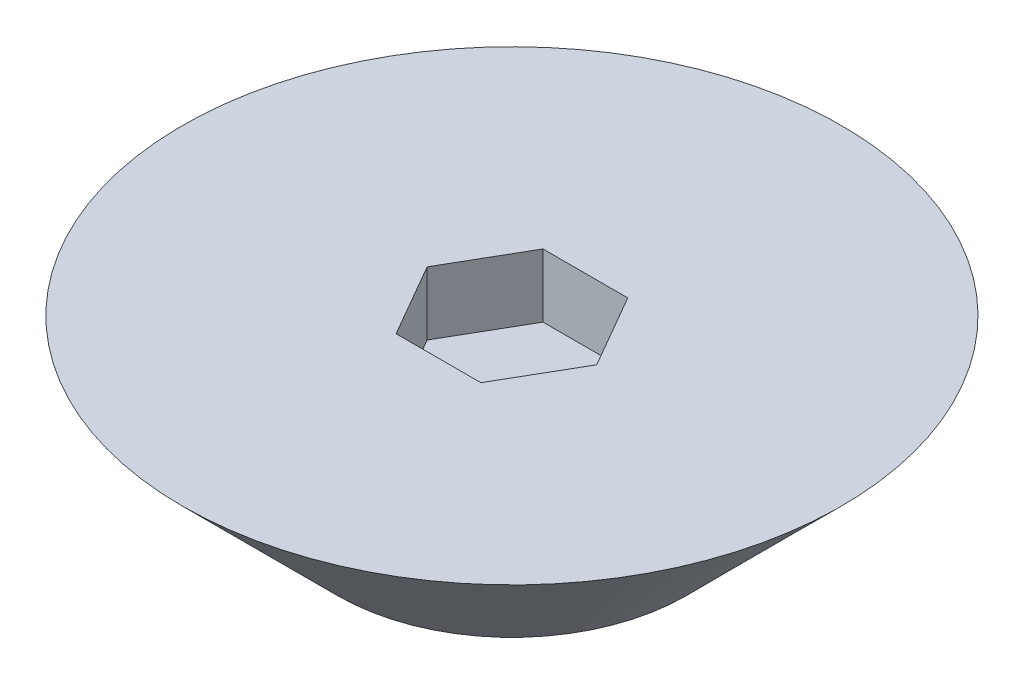
ISO-10303-21;
HEADER;
FILE_DESCRIPTION(('STEP AP214'),'2;1');
FILE_NAME('part.step','',(''),(''),'','','');
FILE_SCHEMA(('AUTOMOTIVE_DESIGN { 1 0 10303 214 1 1 1 1 }'));
ENDSEC;
DATA;
#1=APPLICATION_CONTEXT('core data for automotive mechanical design processes');
#2=APPLICATION_PROTOCOL_DEFINITION('international standard','automotive_design',2000,#1);
#3=PRODUCT_CONTEXT('',#1,'mechanical');
#4=PRODUCT('Part','Part','',(#3));
#5=PRODUCT_RELATED_PRODUCT_CATEGORY('part','',(#4));
#6=PRODUCT_DEFINITION_FORMATION('','',#4);
#7=PRODUCT_DEFINITION_CONTEXT('part definition',#1,'design');
#8=PRODUCT_DEFINITION('design','',#6,#7);
#9=PRODUCT_DEFINITION_SHAPE('','',#8);
#10=(LENGTH_UNIT() NAMED_UNIT(*) SI_UNIT(.MILLI.,.METRE.));
#11=(NAMED_UNIT(*) PLANE_ANGLE_UNIT() SI_UNIT($,.RADIAN.));
#12=(NAMED_UNIT(*) SI_UNIT($,.STERADIAN.) SOLID_ANGLE_UNIT());
#13=UNCERTAINTY_MEASURE_WITH_UNIT(LENGTH_MEASURE(1.E-05),#10,'distance_accuracy_value','');
#14=(GEOMETRIC_REPRESENTATION_CONTEXT(3) GLOBAL_UNCERTAINTY_ASSIGNED_CONTEXT((#13)) GLOBAL_UNIT_ASSIGNED_CONTEXT((#10,
#11,#12)) REPRESENTATION_CONTEXT('',''));
#15=CARTESIAN_POINT('',(0.,0.,0.));
#16=DIRECTION('',(0.,0.,1.));
#17=DIRECTION('',(1.,0.,0.));
#18=AXIS2_PLACEMENT_3D('',#15,#16,#17);
#19=CARTESIAN_POINT('',(0.,2.45,0.));
#20=DIRECTION('',(0.,1.,0.));
#21=DIRECTION('',(0.,0.,1.));
#22=AXIS2_PLACEMENT_3D('',#19,#20,#21);
#23=PLANE('',#22);
#24=DIRECTION('',(0.499999999999995,0.,-0.866025403784441));
#25=VECTOR('',#24,1.);
#26=CARTESIAN_POINT('',(0.668999729555267,2.45,1.15874152183953));
#27=LINE('',#26,#25);
#28=CARTESIAN_POINT('',(0.668999729555267,2.45,1.15874152183953));
#29=VERTEX_POINT('',#28);
#30=CARTESIAN_POINT('',(1.33799945911051,2.45,0.));
#31=VERTEX_POINT('',#30);
#32=EDGE_CURVE('E53',#29,#31,#27,.T.);
#33=ORIENTED_EDGE('',*,*,#32,.F.);
#34=DIRECTION('',(1.,0.,0.));
#35=VECTOR('',#34,1.);
#36=CARTESIAN_POINT('',(-0.668999729555242,2.45,1.15874152183954));
#37=LINE('',#36,#35);
#38=CARTESIAN_POINT('',(-0.668999729555242,2.45,1.15874152183954));
#39=VERTEX_POINT('',#38);
#40=EDGE_CURVE('E136',#39,#29,#37,.T.);
#41=ORIENTED_EDGE('',*,*,#40,.F.);
#42=DIRECTION('',(0.500000000000007,0.,0.866025403784435));
#43=VECTOR('',#42,1.);
#44=CARTESIAN_POINT('',(-1.33799945911051,2.45,0.));
#45=LINE('',#44,#43);
#46=CARTESIAN_POINT('',(-1.33799945911051,2.45,0.));
#47=VERTEX_POINT('',#46);
#48=EDGE_CURVE('E134',#47,#39,#45,.T.);
#49=ORIENTED_EDGE('',*,*,#48,.F.);
#50=DIRECTION('',(-0.499999999999995,0.,0.866025403784442));
#51=VECTOR('',#50,1.);
#52=CARTESIAN_POINT('',(-0.668999729555258,2.45,-1.15874152183953));
#53=LINE('',#52,#51);
#54=CARTESIAN_POINT('',(-0.668999729555258,2.45,-1.15874152183953));
#55=VERTEX_POINT('',#54);
#56=EDGE_CURVE('E101',#55,#47,#53,.T.);
#57=ORIENTED_EDGE('',*,*,#56,.F.);
#58=DIRECTION('',(-1.,0.,0.));
#59=VECTOR('',#58,1.);
#60=CARTESIAN_POINT('',(0.66899972955525,2.45,-1.15874152183954));
#61=LINE('',#60,#59);
#62=CARTESIAN_POINT('',(0.66899972955525,2.45,-1.15874152183954));
#63=VERTEX_POINT('',#62);
#64=EDGE_CURVE('E130',#63,#55,#61,.T.);
#65=ORIENTED_EDGE('',*,*,#64,.F.);
#66=DIRECTION('',(-0.500000000000001,0.,-0.866025403784438));
#67=VECTOR('',#66,1.);
#68=CARTESIAN_POINT('',(1.33799945911051,2.45,0.));
#69=LINE('',#68,#67);
#70=EDGE_CURVE('E127',#31,#63,#69,.T.);
#71=ORIENTED_EDGE('',*,*,#70,.F.);
#72=EDGE_LOOP('',(#33,#41,#49,#57,#65,#71));
#73=FACE_BOUND('',#72,.T.);
#74=CARTESIAN_POINT('',(0.,2.45,0.));
#75=DIRECTION('',(0.,1.,0.));
#76=DIRECTION('',(0.,0.,1.));
#77=AXIS2_PLACEMENT_3D('',#74,#75,#76);
#78=CIRCLE('',#77,5.2);
#79=CARTESIAN_POINT('',(0.,2.45,5.2));
#80=VERTEX_POINT('',#79);
#81=EDGE_CURVE('E12',#80,#80,#78,.T.);
#82=ORIENTED_EDGE('',*,*,#81,.T.);
#83=EDGE_LOOP('',(#82));
#84=FACE_BOUND('',#83,.T.);
#85=ADVANCED_FACE('F37',(#73,#84),#23,.T.);
#86=CARTESIAN_POINT('',(0.,0.,0.));
#87=DIRECTION('',(0.,1.,0.));
#88=DIRECTION('',(0.,0.,1.));
#89=AXIS2_PLACEMENT_3D('',#86,#87,#88);
#90=PLANE('',#89);
#91=CARTESIAN_POINT('',(0.,0.,0.));
#92=DIRECTION('',(0.,1.,0.));
#93=DIRECTION('',(0.,0.,1.));
#94=AXIS2_PLACEMENT_3D('',#91,#92,#93);
#95=CIRCLE('',#94,2.75);
#96=CARTESIAN_POINT('',(0.,0.,2.75));
#97=VERTEX_POINT('',#96);
#98=EDGE_CURVE('E46',#97,#97,#95,.T.);
#99=ORIENTED_EDGE('',*,*,#98,.F.);
#100=EDGE_LOOP('',(#99));
#101=FACE_BOUND('',#100,.T.);
#102=ADVANCED_FACE('F164',(#101),#90,.F.);
#103=CARTESIAN_POINT('',(0.,0.,0.));
#104=DIRECTION('',(0.,1.,0.));
#105=DIRECTION('',(0.,0.,1.));
#106=AXIS2_PLACEMENT_3D('',#103,#104,#105);
#107=CONICAL_SURFACE('',#106,2.75,0.785398163397448);
#108=ORIENTED_EDGE('',*,*,#98,.T.);
#109=EDGE_LOOP('',(#108));
#110=FACE_BOUND('',#109,.T.);
#111=ORIENTED_EDGE('',*,*,#81,.F.);
#112=EDGE_LOOP('',(#111));
#113=FACE_BOUND('',#112,.T.);
#114=ADVANCED_FACE('F154',(#110,#113),#107,.T.);
#115=CARTESIAN_POINT('',(0.668999729555267,1.45,1.15874152183953));
#116=DIRECTION('',(0.866025403784442,0.,0.499999999999995));
#117=DIRECTION('',(0.499999999999995,0.,-0.866025403784442));
#118=AXIS2_PLACEMENT_3D('',#115,#116,#117);
#119=PLANE('',#118);
#120=ORIENTED_EDGE('',*,*,#32,.T.);
#121=DIRECTION('',(0.,1.,0.));
#122=VECTOR('',#121,1.);
#123=CARTESIAN_POINT('',(1.33799945911051,1.45,0.));
#124=LINE('',#123,#122);
#125=CARTESIAN_POINT('',(1.33799945911051,1.45,0.));
#126=VERTEX_POINT('',#125);
#127=EDGE_CURVE('E83',#126,#31,#124,.T.);
#128=ORIENTED_EDGE('',*,*,#127,.F.);
#129=DIRECTION('',(0.499999999999995,0.,-0.866025403784441));
#130=VECTOR('',#129,1.);
#131=CARTESIAN_POINT('',(0.668999729555267,1.45,1.15874152183953));
#132=LINE('',#131,#130);
#133=CARTESIAN_POINT('',(0.668999729555267,1.45,1.15874152183953));
#134=VERTEX_POINT('',#133);
#135=EDGE_CURVE('E138',#134,#126,#132,.T.);
#136=ORIENTED_EDGE('',*,*,#135,.F.);
#137=DIRECTION('',(0.,1.,0.));
#138=VECTOR('',#137,1.);
#139=CARTESIAN_POINT('',(0.668999729555267,1.45,1.15874152183953));
#140=LINE('',#139,#138);
#141=EDGE_CURVE('E61',#134,#29,#140,.T.);
#142=ORIENTED_EDGE('',*,*,#141,.T.);
#143=EDGE_LOOP('',(#120,#128,#136,#142));
#144=FACE_BOUND('',#143,.T.);
#145=ADVANCED_FACE('F163',(#144),#119,.F.);
#146=CARTESIAN_POINT('',(-0.668999729555242,1.45,1.15874152183954));
#147=DIRECTION('',(0.,0.,1.));
#148=DIRECTION('',(1.,0.,0.));
#149=AXIS2_PLACEMENT_3D('',#146,#147,#148);
#150=PLANE('',#149);
#151=ORIENTED_EDGE('',*,*,#40,.T.);
#152=ORIENTED_EDGE('',*,*,#141,.F.);
#153=DIRECTION('',(1.,0.,0.));
#154=VECTOR('',#153,1.);
#155=CARTESIAN_POINT('',(-0.668999729555242,1.45,1.15874152183954));
#156=LINE('',#155,#154);
#157=CARTESIAN_POINT('',(-0.668999729555242,1.45,1.15874152183954));
#158=VERTEX_POINT('',#157);
#159=EDGE_CURVE('E113',#158,#134,#156,.T.);
#160=ORIENTED_EDGE('',*,*,#159,.F.);
#161=DIRECTION('',(0.,1.,0.));
#162=VECTOR('',#161,1.);
#163=CARTESIAN_POINT('',(-0.668999729555242,1.45,1.15874152183954));
#164=LINE('',#163,#162);
#165=EDGE_CURVE('E105',#158,#39,#164,.T.);
#166=ORIENTED_EDGE('',*,*,#165,.T.);
#167=EDGE_LOOP('',(#151,#152,#160,#166));
#168=FACE_BOUND('',#167,.T.);
#169=ADVANCED_FACE('F211',(#168),#150,.F.);
#170=CARTESIAN_POINT('',(-1.33799945911051,1.45,0.));
#171=DIRECTION('',(-0.866025403784435,0.,0.500000000000007));
#172=DIRECTION('',(0.500000000000007,0.,0.866025403784435));
#173=AXIS2_PLACEMENT_3D('',#170,#171,#172);
#174=PLANE('',#173);
#175=ORIENTED_EDGE('',*,*,#48,.T.);
#176=ORIENTED_EDGE('',*,*,#165,.F.);
#177=DIRECTION('',(0.500000000000007,0.,0.866025403784435));
#178=VECTOR('',#177,1.);
#179=CARTESIAN_POINT('',(-1.33799945911051,1.45,0.));
#180=LINE('',#179,#178);
#181=CARTESIAN_POINT('',(-1.33799945911051,1.45,0.));
#182=VERTEX_POINT('',#181);
#183=EDGE_CURVE('E109',#182,#158,#180,.T.);
#184=ORIENTED_EDGE('',*,*,#183,.F.);
#185=DIRECTION('',(0.,1.,0.));
#186=VECTOR('',#185,1.);
#187=CARTESIAN_POINT('',(-1.33799945911051,1.45,0.));
#188=LINE('',#187,#186);
#189=EDGE_CURVE('E94',#182,#47,#188,.T.);
#190=ORIENTED_EDGE('',*,*,#189,.T.);
#191=EDGE_LOOP('',(#175,#176,#184,#190));
#192=FACE_BOUND('',#191,.T.);
#193=ADVANCED_FACE('F110',(#192),#174,.F.);
#194=CARTESIAN_POINT('',(-0.668999729555258,1.45,-1.15874152183953));
#195=DIRECTION('',(-0.866025403784442,0.,-0.499999999999995));
#196=DIRECTION('',(-0.499999999999995,0.,0.866025403784442));
#197=AXIS2_PLACEMENT_3D('',#194,#195,#196);
#198=PLANE('',#197);
#199=ORIENTED_EDGE('',*,*,#56,.T.);
#200=ORIENTED_EDGE('',*,*,#189,.F.);
#201=DIRECTION('',(-0.499999999999995,0.,0.866025403784442));
#202=VECTOR('',#201,1.);
#203=CARTESIAN_POINT('',(-0.668999729555258,1.45,-1.15874152183953));
#204=LINE('',#203,#202);
#205=CARTESIAN_POINT('',(-0.668999729555258,1.45,-1.15874152183953));
#206=VERTEX_POINT('',#205);
#207=EDGE_CURVE('E98',#206,#182,#204,.T.);
#208=ORIENTED_EDGE('',*,*,#207,.F.);
#209=DIRECTION('',(0.,1.,0.));
#210=VECTOR('',#209,1.);
#211=CARTESIAN_POINT('',(-0.668999729555258,1.45,-1.15874152183953));
#212=LINE('',#211,#210);
#213=EDGE_CURVE('E106',#206,#55,#212,.T.);
#214=ORIENTED_EDGE('',*,*,#213,.T.);
#215=EDGE_LOOP('',(#199,#200,#208,#214));
#216=FACE_BOUND('',#215,.T.);
#217=ADVANCED_FACE('F96',(#216),#198,.F.);
#218=CARTESIAN_POINT('',(0.66899972955525,1.45,-1.15874152183954));
#219=DIRECTION('',(0.,0.,-1.));
#220=DIRECTION('',(-1.,0.,0.));
#221=AXIS2_PLACEMENT_3D('',#218,#219,#220);
#222=PLANE('',#221);
#223=ORIENTED_EDGE('',*,*,#64,.T.);
#224=ORIENTED_EDGE('',*,*,#213,.F.);
#225=DIRECTION('',(-1.,0.,0.));
#226=VECTOR('',#225,1.);
#227=CARTESIAN_POINT('',(0.66899972955525,1.45,-1.15874152183954));
#228=LINE('',#227,#226);
#229=CARTESIAN_POINT('',(0.66899972955525,1.45,-1.15874152183954));
#230=VERTEX_POINT('',#229);
#231=EDGE_CURVE('E119',#230,#206,#228,.T.);
#232=ORIENTED_EDGE('',*,*,#231,.F.);
#233=DIRECTION('',(0.,1.,0.));
#234=VECTOR('',#233,1.);
#235=CARTESIAN_POINT('',(0.66899972955525,1.45,-1.15874152183954));
#236=LINE('',#235,#234);
#237=EDGE_CURVE('E142',#230,#63,#236,.T.);
#238=ORIENTED_EDGE('',*,*,#237,.T.);
#239=EDGE_LOOP('',(#223,#224,#232,#238));
#240=FACE_BOUND('',#239,.T.);
#241=ADVANCED_FACE('F219',(#240),#222,.F.);
#242=CARTESIAN_POINT('',(1.33799945911051,1.45,0.));
#243=DIRECTION('',(0.866025403784438,0.,-0.500000000000001));
#244=DIRECTION('',(-0.500000000000001,0.,-0.866025403784438));
#245=AXIS2_PLACEMENT_3D('',#242,#243,#244);
#246=PLANE('',#245);
#247=ORIENTED_EDGE('',*,*,#70,.T.);
#248=ORIENTED_EDGE('',*,*,#237,.F.);
#249=DIRECTION('',(-0.500000000000001,0.,-0.866025403784438));
#250=VECTOR('',#249,1.);
#251=CARTESIAN_POINT('',(1.33799945911051,1.45,0.));
#252=LINE('',#251,#250);
#253=EDGE_CURVE('E121',#126,#230,#252,.T.);
#254=ORIENTED_EDGE('',*,*,#253,.F.);
#255=ORIENTED_EDGE('',*,*,#127,.T.);
#256=EDGE_LOOP('',(#247,#248,#254,#255));
#257=FACE_BOUND('',#256,.T.);
#258=ADVANCED_FACE('F208',(#257),#246,.F.);
#259=CARTESIAN_POINT('',(0.,1.45,0.));
#260=DIRECTION('',(0.,1.,0.));
#261=DIRECTION('',(0.,0.,1.));
#262=AXIS2_PLACEMENT_3D('',#259,#260,#261);
#263=PLANE('',#262);
#264=ORIENTED_EDGE('',*,*,#135,.T.);
#265=ORIENTED_EDGE('',*,*,#253,.T.);
#266=ORIENTED_EDGE('',*,*,#231,.T.);
#267=ORIENTED_EDGE('',*,*,#207,.T.);
#268=ORIENTED_EDGE('',*,*,#183,.T.);
#269=ORIENTED_EDGE('',*,*,#159,.T.);
#270=EDGE_LOOP('',(#264,#265,#266,#267,#268,#269));
#271=FACE_BOUND('',#270,.T.);
#272=ADVANCED_FACE('F116',(#271),#263,.T.);
#273=CLOSED_SHELL('',(#85,#102,#114,#145,#169,#193,#217,#241,#258,#272));
#274=MANIFOLD_SOLID_BREP('B2',#273);
#275=ADVANCED_BREP_SHAPE_REPRESENTATION('',(#18,#274),#14);
#276=SHAPE_DEFINITION_REPRESENTATION(#9,#275);
ENDSEC;
END-ISO-10303-21;
